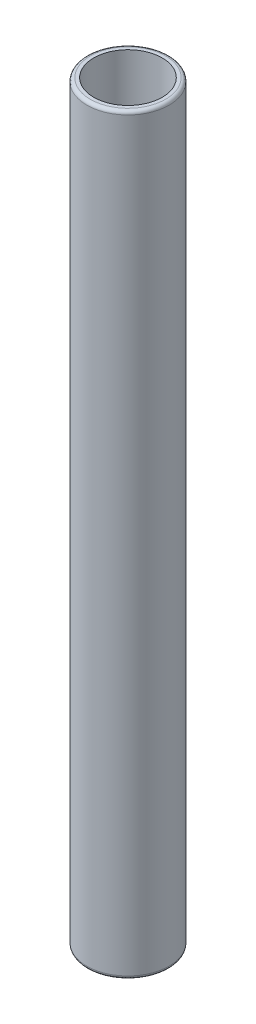
ISO-10303-21;
HEADER;
FILE_DESCRIPTION(('STEP AP214'),'2;1');
FILE_NAME('part.step','',(''),(''),'','','');
FILE_SCHEMA(('AUTOMOTIVE_DESIGN { 1 0 10303 214 1 1 1 1 }'));
ENDSEC;
DATA;
#1=APPLICATION_CONTEXT('core data for automotive mechanical design processes');
#2=APPLICATION_PROTOCOL_DEFINITION('international standard','automotive_design',2000,#1);
#3=PRODUCT_CONTEXT('',#1,'mechanical');
#4=PRODUCT('Part','Part','',(#3));
#5=PRODUCT_RELATED_PRODUCT_CATEGORY('part','',(#4));
#6=PRODUCT_DEFINITION_FORMATION('','',#4);
#7=PRODUCT_DEFINITION_CONTEXT('part definition',#1,'design');
#8=PRODUCT_DEFINITION('design','',#6,#7);
#9=PRODUCT_DEFINITION_SHAPE('','',#8);
#10=(LENGTH_UNIT() NAMED_UNIT(*) SI_UNIT(.MILLI.,.METRE.));
#11=(NAMED_UNIT(*) PLANE_ANGLE_UNIT() SI_UNIT($,.RADIAN.));
#12=(NAMED_UNIT(*) SI_UNIT($,.STERADIAN.) SOLID_ANGLE_UNIT());
#13=UNCERTAINTY_MEASURE_WITH_UNIT(LENGTH_MEASURE(1.E-05),#10,'distance_accuracy_value','');
#14=(GEOMETRIC_REPRESENTATION_CONTEXT(3) GLOBAL_UNCERTAINTY_ASSIGNED_CONTEXT((#13)) GLOBAL_UNIT_ASSIGNED_CONTEXT((#10,
#11,#12)) REPRESENTATION_CONTEXT('',''));
#15=CARTESIAN_POINT('',(0.,0.,0.));
#16=DIRECTION('',(0.,0.,1.));
#17=DIRECTION('',(1.,0.,0.));
#18=AXIS2_PLACEMENT_3D('',#15,#16,#17);
#19=CARTESIAN_POINT('',(0.,110.,0.));
#20=DIRECTION('',(0.,1.,0.));
#21=DIRECTION('',(0.,0.,1.));
#22=AXIS2_PLACEMENT_3D('',#19,#20,#21);
#23=PLANE('',#22);
#24=CARTESIAN_POINT('',(0.,110.,0.));
#25=DIRECTION('',(0.,1.,0.));
#26=DIRECTION('',(0.,0.,1.));
#27=AXIS2_PLACEMENT_3D('',#24,#25,#26);
#28=CIRCLE('',#27,5.5);
#29=CARTESIAN_POINT('',(0.,110.,5.5));
#30=VERTEX_POINT('',#29);
#31=EDGE_CURVE('E10',#30,#30,#28,.T.);
#32=ORIENTED_EDGE('',*,*,#31,.T.);
#33=EDGE_LOOP('',(#32));
#34=FACE_BOUND('',#33,.T.);
#35=CARTESIAN_POINT('',(0.,110.,0.));
#36=DIRECTION('',(0.,1.,0.));
#37=DIRECTION('',(0.,0.,1.));
#38=AXIS2_PLACEMENT_3D('',#35,#36,#37);
#39=CIRCLE('',#38,5.);
#40=CARTESIAN_POINT('',(0.,110.,5.));
#41=VERTEX_POINT('',#40);
#42=EDGE_CURVE('E51',#41,#41,#39,.T.);
#43=ORIENTED_EDGE('',*,*,#42,.F.);
#44=EDGE_LOOP('',(#43));
#45=FACE_BOUND('',#44,.T.);
#46=ADVANCED_FACE('F31',(#34,#45),#23,.T.);
#47=CARTESIAN_POINT('',(0.,0.,0.));
#48=DIRECTION('',(0.,1.,0.));
#49=DIRECTION('',(0.,0.,1.));
#50=AXIS2_PLACEMENT_3D('',#47,#48,#49);
#51=PLANE('',#50);
#52=CARTESIAN_POINT('',(0.,0.,0.));
#53=DIRECTION('',(0.,1.,0.));
#54=DIRECTION('',(0.,0.,1.));
#55=AXIS2_PLACEMENT_3D('',#52,#53,#54);
#56=CIRCLE('',#55,5.5);
#57=CARTESIAN_POINT('',(0.,0.,5.5));
#58=VERTEX_POINT('',#57);
#59=EDGE_CURVE('E38',#58,#58,#56,.F.);
#60=ORIENTED_EDGE('',*,*,#59,.T.);
#61=EDGE_LOOP('',(#60));
#62=FACE_BOUND('',#61,.T.);
#63=CARTESIAN_POINT('',(0.,0.,0.));
#64=DIRECTION('',(0.,1.,0.));
#65=DIRECTION('',(0.,0.,1.));
#66=AXIS2_PLACEMENT_3D('',#63,#64,#65);
#67=CIRCLE('',#66,5.);
#68=CARTESIAN_POINT('',(0.,0.,5.));
#69=VERTEX_POINT('',#68);
#70=EDGE_CURVE('E52',#69,#69,#67,.T.);
#71=ORIENTED_EDGE('',*,*,#70,.T.);
#72=EDGE_LOOP('',(#71));
#73=FACE_BOUND('',#72,.T.);
#74=ADVANCED_FACE('F62',(#62,#73),#51,.F.);
#75=CARTESIAN_POINT('',(0.,110.,0.));
#76=DIRECTION('',(0.,-1.,0.));
#77=DIRECTION('',(0.,0.,-1.));
#78=AXIS2_PLACEMENT_3D('',#75,#76,#77);
#79=CYLINDRICAL_SURFACE('',#78,6.);
#80=CARTESIAN_POINT('',(0.,0.5,0.));
#81=DIRECTION('',(0.,1.,0.));
#82=DIRECTION('',(0.,0.,1.));
#83=AXIS2_PLACEMENT_3D('',#80,#81,#82);
#84=CIRCLE('',#83,6.);
#85=CARTESIAN_POINT('',(0.,0.5,6.));
#86=VERTEX_POINT('',#85);
#87=EDGE_CURVE('E42',#86,#86,#84,.T.);
#88=ORIENTED_EDGE('',*,*,#87,.T.);
#89=EDGE_LOOP('',(#88));
#90=FACE_BOUND('',#89,.T.);
#91=CARTESIAN_POINT('',(0.,109.5,0.));
#92=DIRECTION('',(0.,1.,0.));
#93=DIRECTION('',(0.,0.,1.));
#94=AXIS2_PLACEMENT_3D('',#91,#92,#93);
#95=CIRCLE('',#94,6.);
#96=CARTESIAN_POINT('',(0.,109.5,6.));
#97=VERTEX_POINT('',#96);
#98=EDGE_CURVE('E46',#97,#97,#95,.F.);
#99=ORIENTED_EDGE('',*,*,#98,.T.);
#100=EDGE_LOOP('',(#99));
#101=FACE_BOUND('',#100,.T.);
#102=ADVANCED_FACE('F67',(#90,#101),#79,.T.);
#103=CARTESIAN_POINT('',(0.,110.,0.));
#104=DIRECTION('',(0.,-1.,0.));
#105=DIRECTION('',(0.,0.,-1.));
#106=AXIS2_PLACEMENT_3D('',#103,#104,#105);
#107=CYLINDRICAL_SURFACE('',#106,5.);
#108=ORIENTED_EDGE('',*,*,#42,.T.);
#109=EDGE_LOOP('',(#108));
#110=FACE_BOUND('',#109,.T.);
#111=ORIENTED_EDGE('',*,*,#70,.F.);
#112=EDGE_LOOP('',(#111));
#113=FACE_BOUND('',#112,.T.);
#114=ADVANCED_FACE('F58',(#110,#113),#107,.F.);
#115=CARTESIAN_POINT('',(0.,0.5,0.));
#116=DIRECTION('',(0.,1.,0.));
#117=DIRECTION('',(0.,0.,1.));
#118=AXIS2_PLACEMENT_3D('',#115,#116,#117);
#119=TOROIDAL_SURFACE('',#118,5.5,0.5);
#120=ORIENTED_EDGE('',*,*,#59,.F.);
#121=EDGE_LOOP('',(#120));
#122=FACE_BOUND('',#121,.T.);
#123=ORIENTED_EDGE('',*,*,#87,.F.);
#124=EDGE_LOOP('',(#123));
#125=FACE_BOUND('',#124,.T.);
#126=ADVANCED_FACE('F73',(#122,#125),#119,.T.);
#127=CARTESIAN_POINT('',(0.,109.5,0.));
#128=DIRECTION('',(0.,1.,0.));
#129=DIRECTION('',(0.,0.,1.));
#130=AXIS2_PLACEMENT_3D('',#127,#128,#129);
#131=TOROIDAL_SURFACE('',#130,5.5,0.5);
#132=ORIENTED_EDGE('',*,*,#98,.F.);
#133=EDGE_LOOP('',(#132));
#134=FACE_BOUND('',#133,.T.);
#135=ORIENTED_EDGE('',*,*,#31,.F.);
#136=EDGE_LOOP('',(#135));
#137=FACE_BOUND('',#136,.T.);
#138=ADVANCED_FACE('F33',(#134,#137),#131,.T.);
#139=CLOSED_SHELL('',(#46,#74,#102,#114,#126,#138));
#140=MANIFOLD_SOLID_BREP('B2',#139);
#141=ADVANCED_BREP_SHAPE_REPRESENTATION('',(#18,#140),#14);
#142=SHAPE_DEFINITION_REPRESENTATION(#9,#141);
ENDSEC;
END-ISO-10303-21;
